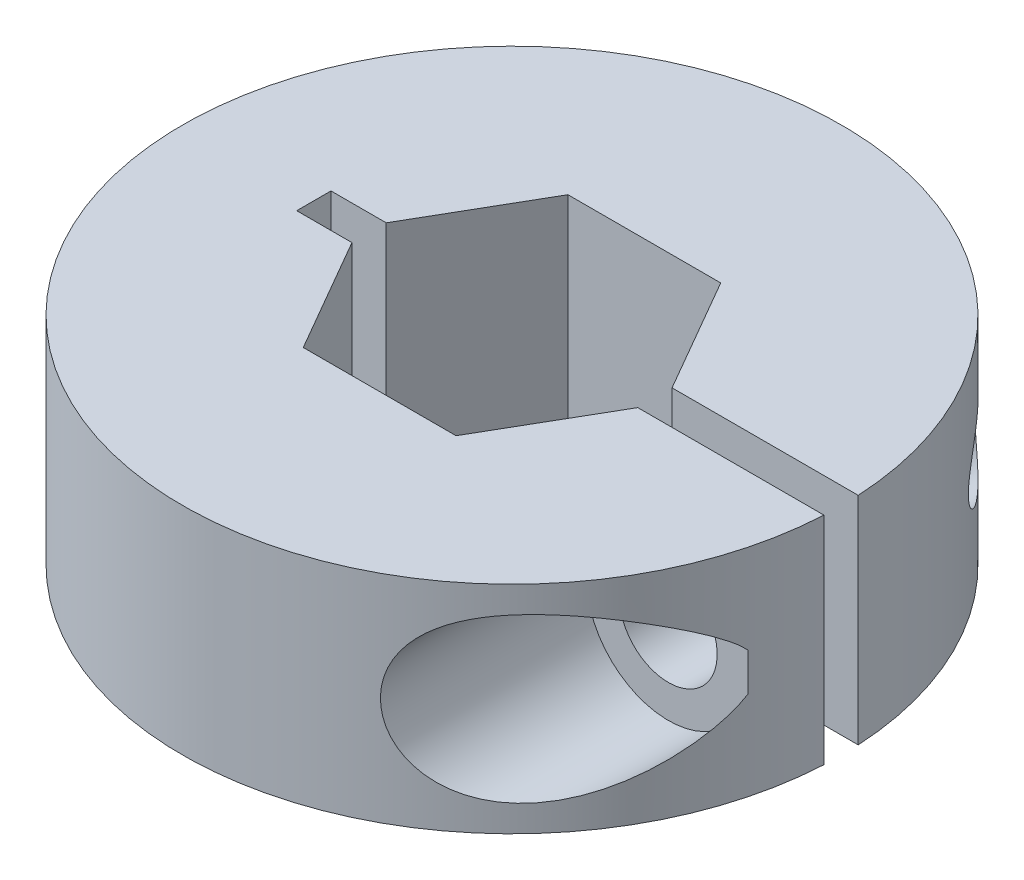
ISO-10303-21;
HEADER;
FILE_DESCRIPTION(('STEP AP214'),'2;1');
FILE_NAME('part.step','',(''),(''),'','','');
FILE_SCHEMA(('AUTOMOTIVE_DESIGN { 1 0 10303 214 1 1 1 1 }'));
ENDSEC;
DATA;
#1=APPLICATION_CONTEXT('core data for automotive mechanical design processes');
#2=APPLICATION_PROTOCOL_DEFINITION('international standard','automotive_design',2000,#1);
#3=PRODUCT_CONTEXT('',#1,'mechanical');
#4=PRODUCT('Part','Part','',(#3));
#5=PRODUCT_RELATED_PRODUCT_CATEGORY('part','',(#4));
#6=PRODUCT_DEFINITION_FORMATION('','',#4);
#7=PRODUCT_DEFINITION_CONTEXT('part definition',#1,'design');
#8=PRODUCT_DEFINITION('design','',#6,#7);
#9=PRODUCT_DEFINITION_SHAPE('','',#8);
#10=(LENGTH_UNIT() NAMED_UNIT(*) SI_UNIT(.MILLI.,.METRE.));
#11=(NAMED_UNIT(*) PLANE_ANGLE_UNIT() SI_UNIT($,.RADIAN.));
#12=(NAMED_UNIT(*) SI_UNIT($,.STERADIAN.) SOLID_ANGLE_UNIT());
#13=UNCERTAINTY_MEASURE_WITH_UNIT(LENGTH_MEASURE(1.E-05),#10,'distance_accuracy_value','');
#14=(GEOMETRIC_REPRESENTATION_CONTEXT(3) GLOBAL_UNCERTAINTY_ASSIGNED_CONTEXT((#13)) GLOBAL_UNIT_ASSIGNED_CONTEXT((#10,
#11,#12)) REPRESENTATION_CONTEXT('',''));
#15=CARTESIAN_POINT('',(0.,0.,0.));
#16=DIRECTION('',(0.,0.,1.));
#17=DIRECTION('',(1.,0.,0.));
#18=AXIS2_PLACEMENT_3D('',#15,#16,#17);
#19=CARTESIAN_POINT('',(11.5355224713626,5.207,-0.8255));
#20=DIRECTION('',(0.,0.,1.));
#21=DIRECTION('',(1.,0.,0.));
#22=AXIS2_PLACEMENT_3D('',#19,#20,#21);
#23=CYLINDRICAL_SURFACE('',#22,1.7272);
#24=CARTESIAN_POINT('',(11.5355224713626,5.207,-0.8255));
#25=DIRECTION('',(0.,0.,1.));
#26=DIRECTION('',(1.,0.,0.));
#27=AXIS2_PLACEMENT_3D('',#24,#25,#26);
#28=CIRCLE('',#27,1.7272);
#29=CARTESIAN_POINT('',(13.2627224713626,5.207,-0.8255));
#30=VERTEX_POINT('',#29);
#31=EDGE_CURVE('E149',#30,#30,#28,.T.);
#32=ORIENTED_EDGE('',*,*,#31,.T.);
#33=EDGE_LOOP('',(#32));
#34=FACE_BOUND('',#33,.T.);
#35=CARTESIAN_POINT('',(9.80832247136264,5.20699999999743,-12.4824851410992));
#36=CARTESIAN_POINT('',(9.80832717981811,5.12563487030982,-12.4824821258486));
#37=CARTESIAN_POINT('',(9.81411079583699,5.0442256232286,-12.4779435373603));
#38=CARTESIAN_POINT('',(9.83686582287657,4.88396366971117,-12.4600118301465));
#39=CARTESIAN_POINT('',(9.85384699497057,4.80511325682585,-12.4466109860338));
#40=CARTESIAN_POINT('',(9.89781460406895,4.6525532944237,-12.4116746379421));
#41=CARTESIAN_POINT('',(9.92476014673078,4.57882417582134,-12.390172375933));
#42=CARTESIAN_POINT('',(9.98715397992801,4.43775969125408,-12.3399342921144));
#43=CARTESIAN_POINT('',(10.022603109197,4.37042495690105,-12.3111977567536));
#44=CARTESIAN_POINT('',(10.1027776748239,4.23914613421888,-12.245503092222));
#45=CARTESIAN_POINT('',(10.14794322383,4.17567411284794,-12.2081444959402));
#46=CARTESIAN_POINT('',(10.2441079781266,4.05752972333503,-12.127564817614));
#47=CARTESIAN_POINT('',(10.2951102530445,4.00286202224389,-12.0843406485308));
#48=CARTESIAN_POINT('',(10.4279541873246,3.87712784857541,-11.9701449755629));
#49=CARTESIAN_POINT('',(10.5124336095879,3.81158833642804,-11.8961299284085));
#50=CARTESIAN_POINT('',(10.6864152434717,3.69935097703062,-11.7400987839687));
#51=CARTESIAN_POINT('',(10.7759285135658,3.65269661801682,-11.6580647535705));
#52=CARTESIAN_POINT('',(10.9876347057071,3.56372770631253,-11.4592780978034));
#53=CARTESIAN_POINT('',(11.1105618290983,3.52831914863097,-11.3402260797538));
#54=CARTESIAN_POINT('',(11.3547038190156,3.48481171790953,-11.0957793487054));
#55=CARTESIAN_POINT('',(11.4759172572962,3.4767344250237,-10.9703797030103));
#56=CARTESIAN_POINT('',(11.7165145741764,3.48499784045012,-10.713107641636));
#57=CARTESIAN_POINT('',(11.8357861765314,3.50192450935579,-10.5811522006071));
#58=CARTESIAN_POINT('',(12.0674609420617,3.55941700457341,-10.3161509065639));
#59=CARTESIAN_POINT('',(12.1798593905749,3.59999886064155,-10.1831043745149));
#60=CARTESIAN_POINT('',(12.3400088133385,3.67749864288504,-9.98732469929324));
#61=CARTESIAN_POINT('',(12.3911829471804,3.70549591029297,-9.92374495110965));
#62=CARTESIAN_POINT('',(12.4912287531848,3.7671047920721,-9.79751484604641));
#63=CARTESIAN_POINT('',(12.5401013174625,3.80071420775975,-9.73486413562075));
#64=CARTESIAN_POINT('',(12.6351852338489,3.87375177739436,-9.61112891382545));
#65=CARTESIAN_POINT('',(12.6814007081626,3.91317056044534,-9.55004206271455));
#66=CARTESIAN_POINT('',(12.7708305377531,3.99826452456761,-9.4301166461838));
#67=CARTESIAN_POINT('',(12.8140468770234,4.04393550905798,-9.37127660626456));
#68=CARTESIAN_POINT('',(12.9000943738688,4.14589137436045,-9.25251107317332));
#69=CARTESIAN_POINT('',(12.9426460987988,4.20271940107025,-9.19284355732076));
#70=CARTESIAN_POINT('',(13.0225103587165,4.32528009175886,-9.0793525390714));
#71=CARTESIAN_POINT('',(13.0598280522777,4.39100386086868,-9.02552329460823));
#72=CARTESIAN_POINT('',(13.1200452532256,4.51688883087252,-8.93768621875741));
#73=CARTESIAN_POINT('',(13.1443146866712,4.57514230851238,-8.90191501244982));
#74=CARTESIAN_POINT('',(13.1872208475752,4.69777026832146,-8.83822975737732));
#75=CARTESIAN_POINT('',(13.2058644759664,4.76213712293275,-8.81030608529239));
#76=CARTESIAN_POINT('',(13.234325563421,4.88910807383453,-8.76748832758546));
#77=CARTESIAN_POINT('',(13.2448675286978,4.95117965655284,-8.75152917271738));
#78=CARTESIAN_POINT('',(13.2590584707905,5.07784361741996,-8.7300155693831));
#79=CARTESIAN_POINT('',(13.2627194459847,5.14243140688724,-8.72444300995837));
#80=CARTESIAN_POINT('',(13.262725145981,5.26408257050599,-8.72443348794094));
#81=CARTESIAN_POINT('',(13.2598688997014,5.32115013783756,-8.72878038022016));
#82=CARTESIAN_POINT('',(13.2487365570514,5.43352137959228,-8.74566773124609));
#83=CARTESIAN_POINT('',(13.2404558333609,5.48882350573794,-8.75821518541536));
#84=CARTESIAN_POINT('',(13.2166269340722,5.60913390677291,-8.79414330968239));
#85=CARTESIAN_POINT('',(13.199819520121,5.67332649999486,-8.81938955673118));
#86=CARTESIAN_POINT('',(13.1604822969934,5.79597850138733,-8.87798279397336));
#87=CARTESIAN_POINT('',(13.1379415408771,5.85442664205613,-8.91134527550615));
#88=CARTESIAN_POINT('',(13.0752089482557,5.99523365279143,-9.00327894915459));
#89=CARTESIAN_POINT('',(13.0320255705073,6.073655092563,-9.06578752971956));
#90=CARTESIAN_POINT('',(12.9383837057909,6.21826021759132,-9.19894193080987));
#91=CARTESIAN_POINT('',(12.8879066178535,6.28441159472208,-9.26960846078696));
#92=CARTESIAN_POINT('',(12.7911223446032,6.39487415168808,-9.40256955155641));
#93=CARTESIAN_POINT('',(12.7457160713092,6.44097092437183,-9.46406191074572));
#94=CARTESIAN_POINT('',(12.6517829098795,6.52655428085678,-9.58927232519942));
#95=CARTESIAN_POINT('',(12.6032541298207,6.56603680388528,-9.65299171893625));
#96=CARTESIAN_POINT('',(12.5034802248503,6.63881395842752,-9.78188389284458));
#97=CARTESIAN_POINT('',(12.4522333923453,6.67210463934609,-9.84705757140325));
#98=CARTESIAN_POINT('',(12.3473470136312,6.73272208765695,-9.97826239329041));
#99=CARTESIAN_POINT('',(12.2937065215548,6.76004647184662,-10.0442938681432));
#100=CARTESIAN_POINT('',(12.1242864398467,6.8356123851239,-10.2493719701347));
#101=CARTESIAN_POINT('',(12.0048171331494,6.8739700354809,-10.3891498294603));
#102=CARTESIAN_POINT('',(11.7586774724809,6.92431613088359,-10.6669377492714));
#103=CARTESIAN_POINT('',(11.6320119395124,6.9363220210857,-10.8049489191168));
#104=CARTESIAN_POINT('',(11.3885918016584,6.93174040892143,-11.0608861221596));
#105=CARTESIAN_POINT('',(11.2723284996894,6.91822212597253,-11.1793231562402));
#106=CARTESIAN_POINT('',(11.0390540167357,6.86561354304054,-11.4097164549072));
#107=CARTESIAN_POINT('',(10.9220439388385,6.82655489777794,-11.5216805553272));
#108=CARTESIAN_POINT('',(10.7216922033512,6.73335386320795,-11.7078861429454));
#109=CARTESIAN_POINT('',(10.6374548545198,6.68570575256117,-11.7844057075281));
#110=CARTESIAN_POINT('',(10.4740584622924,6.57313435558642,-11.9298622687799));
#111=CARTESIAN_POINT('',(10.3948927866374,6.50823422676082,-11.9988092561364));
#112=CARTESIAN_POINT('',(10.261057782096,6.37571888645794,-12.1133162545035));
#113=CARTESIAN_POINT('',(10.204708395014,6.31144129073364,-12.1607639842875));
#114=CARTESIAN_POINT('',(10.1002119172092,6.17172132487359,-12.2476917458352));
#115=CARTESIAN_POINT('',(10.0520576429292,6.09628884228355,-12.2871787613552));
#116=CARTESIAN_POINT('',(9.97311933777412,5.9473580255924,-12.3513043133526));
#117=CARTESIAN_POINT('',(9.94081685438444,5.87524183963921,-12.3772779687403));
#118=CARTESIAN_POINT('',(9.88593705295111,5.72512028865784,-12.4211560456636));
#119=CARTESIAN_POINT('',(9.86334660751703,5.64712304161943,-12.439071360875));
#120=CARTESIAN_POINT('',(9.83379783381764,5.50859138898149,-12.4624353660991));
#121=CARTESIAN_POINT('',(9.82427937970143,5.44893325171343,-12.4699328809969));
#122=CARTESIAN_POINT('',(9.81153959665097,5.32852502649915,-12.4799591655278));
#123=CARTESIAN_POINT('',(9.80831895443179,5.26777482020222,-12.4824873933087));
#124=CARTESIAN_POINT('',(9.80832247136264,5.20699999999743,-12.4824851410992));
#125=B_SPLINE_CURVE_WITH_KNOTS('',3,(#35,#36,#37,#38,#39,#40,#41,#42,#43,#44,#45,#46,#47,#48,
#49,#50,#51,#52,#53,#54,#55,#56,#57,#58,#59,#60,#61,#62,#63,#64,#65,#66,#67,#68,#69,#70,#71,#72,
#73,#74,#75,#76,#77,#78,#79,#80,#81,#82,#83,#84,#85,#86,#87,#88,#89,#90,#91,#92,#93,#94,#95,#96,
#97,#98,#99,#100,#101,#102,#103,#104,#105,#106,#107,#108,#109,#110,#111,#112,#113,#114,#115,
#116,#117,#118,#119,#120,#121,#122,#123,#124),.UNSPECIFIED.,.T.,.F.,(4,2,2,2,2,2,2,2,2,2,2,2,2,
2,2,2,2,2,2,2,2,2,2,2,2,2,2,2,2,2,2,2,2,2,2,2,2,2,2,2,2,2,2,2,4),(0.,0.243850099537198,
0.487913048275523,0.730985268523845,0.974081473560499,1.23231192329565,1.49067881012542,
1.87862942568134,2.26746838993736,2.78891332927559,3.31076989389637,3.84505162845797,
4.37969583653259,4.63837853438194,4.89696012430514,5.15512908000341,5.41312559040198,
5.69074990671668,5.96809864894905,6.18502253006738,6.40167922807831,6.59544081814176,
6.78886423166116,6.95986231459054,7.13100645676755,7.34281289452125,7.55502682048568,
7.88077712761974,8.20737335088665,8.47480972295327,8.74240968872904,9.01017981057518,
9.27805669676576,9.8394344127398,10.4004403782291,10.8982375632774,11.3954189450155,
11.7642884082849,12.1326652141258,12.4248541919804,12.7167857127508,12.9652811581962,
13.21343965769,13.3955610444386,13.5777022886447),.UNSPECIFIED.);
#126=CARTESIAN_POINT('',(9.80832247136264,5.20699999999743,-12.4824851410992));
#127=VERTEX_POINT('',#126);
#128=EDGE_CURVE('E124',#127,#127,#125,.T.);
#129=ORIENTED_EDGE('',*,*,#128,.F.);
#130=EDGE_LOOP('',(#129));
#131=FACE_BOUND('',#130,.T.);
#132=ADVANCED_FACE('F17',(#34,#131),#23,.F.);
#133=CARTESIAN_POINT('',(11.5355224713626,5.207,4.0005));
#134=DIRECTION('',(0.,0.,-1.));
#135=DIRECTION('',(-1.,0.,0.));
#136=AXIS2_PLACEMENT_3D('',#133,#134,#135);
#137=PLANE('',#136);
#138=DIRECTION('',(0.,-1.,0.));
#139=VECTOR('',#138,1.);
#140=CARTESIAN_POINT('',(15.3626698444639,10.414,4.0005));
#141=LINE('',#140,#139);
#142=CARTESIAN_POINT('',(15.3626698444639,6.13053234083285,4.0005));
#143=VERTEX_POINT('',#142);
#144=CARTESIAN_POINT('',(15.3626698444639,4.28346765916715,4.0005));
#145=VERTEX_POINT('',#144);
#146=EDGE_CURVE('E109',#143,#145,#141,.T.);
#147=ORIENTED_EDGE('',*,*,#146,.F.);
#148=CARTESIAN_POINT('',(11.5355224713626,5.207,4.0005));
#149=DIRECTION('',(0.,0.,-1.));
#150=DIRECTION('',(-1.,0.,0.));
#151=AXIS2_PLACEMENT_3D('',#148,#149,#150);
#152=CIRCLE('',#151,3.937);
#153=EDGE_CURVE('E21',#143,#145,#152,.F.);
#154=ORIENTED_EDGE('',*,*,#153,.T.);
#155=EDGE_LOOP('',(#147,#154));
#156=FACE_BOUND('',#155,.T.);
#157=CARTESIAN_POINT('',(11.5355224713626,5.207,4.0005));
#158=DIRECTION('',(0.,0.,-1.));
#159=DIRECTION('',(-1.,0.,0.));
#160=AXIS2_PLACEMENT_3D('',#157,#158,#159);
#161=CIRCLE('',#160,2.3495);
#162=CARTESIAN_POINT('',(9.18602247136264,5.207,4.0005));
#163=VERTEX_POINT('',#162);
#164=EDGE_CURVE('E116',#163,#163,#161,.T.);
#165=ORIENTED_EDGE('',*,*,#164,.T.);
#166=EDGE_LOOP('',(#165));
#167=FACE_BOUND('',#166,.T.);
#168=ADVANCED_FACE('F112',(#156,#167),#137,.F.);
#169=CARTESIAN_POINT('',(11.5355224713626,5.207,15.875));
#170=DIRECTION('',(0.,0.,-1.));
#171=DIRECTION('',(-1.,0.,0.));
#172=AXIS2_PLACEMENT_3D('',#169,#170,#171);
#173=CYLINDRICAL_SURFACE('',#172,3.937);
#174=CARTESIAN_POINT('',(15.3626698444639,4.28346765916715,4.0005));
#175=CARTESIAN_POINT('',(15.3479878102032,4.22275565161266,4.05691337523431));
#176=CARTESIAN_POINT('',(15.3324022229872,4.16437618974075,4.11546175466009));
#177=CARTESIAN_POINT('',(15.2996213319844,4.05156142205026,4.23568386274317));
#178=CARTESIAN_POINT('',(15.2824281858667,3.99712099861108,4.29735335262564));
#179=CARTESIAN_POINT('',(15.2466523266804,3.89149158169119,4.42260897160088));
#180=CARTESIAN_POINT('',(15.2280746739571,3.84029190125644,4.48618765839513));
#181=CARTESIAN_POINT('',(15.1895554439536,3.74041279747954,4.61492644979825));
#182=CARTESIAN_POINT('',(15.1696133417435,3.69173435690481,4.68008715674993));
#183=CARTESIAN_POINT('',(15.1078570278175,3.54893582596276,4.87721334));
#184=CARTESIAN_POINT('',(15.0640962288833,3.4580047315441,5.01088134940333));
#185=CARTESIAN_POINT('',(14.9715754713928,3.2825976491534,5.28090788528207));
#186=CARTESIAN_POINT('',(14.9228091231074,3.19813015825649,5.41726966663242));
#187=CARTESIAN_POINT('',(14.8190639822993,3.03257761196911,5.69504326840225));
#188=CARTESIAN_POINT('',(14.7639560574971,2.95163881999537,5.83649388621773));
#189=CARTESIAN_POINT('',(14.6486274420097,2.79494597008219,6.1201959521816));
#190=CARTESIAN_POINT('',(14.588406127807,2.71919254647732,6.26244749601315));
#191=CARTESIAN_POINT('',(14.4628364883902,2.57258998585137,6.54722863005592));
#192=CARTESIAN_POINT('',(14.3974878864736,2.50174111390135,6.68975823486785));
#193=CARTESIAN_POINT('',(14.2616342247146,2.36489288413567,6.97469271710385));
#194=CARTESIAN_POINT('',(14.1911287034649,2.2988939613233,7.11709758221064));
#195=CARTESIAN_POINT('',(13.971394039715,2.10792124042986,7.5444373570761));
#196=CARTESIAN_POINT('',(13.8142859919674,1.99036865854931,7.8287231889667));
#197=CARTESIAN_POINT('',(13.4789401877745,1.77734955008738,8.39293840159205));
#198=CARTESIAN_POINT('',(13.3007148666307,1.68187012212227,8.67287023746034));
#199=CARTESIAN_POINT('',(12.9915561505229,1.54678540402948,9.12582793724426));
#200=CARTESIAN_POINT('',(12.8668771170751,1.49946871418071,9.30084848782579));
#201=CARTESIAN_POINT('',(12.6090840863585,1.41678137130894,9.64744697054715));
#202=CARTESIAN_POINT('',(12.4759723168987,1.38140757864394,9.81902579630081));
#203=CARTESIAN_POINT('',(12.2020090945498,1.32430912731004,10.1574537187412));
#204=CARTESIAN_POINT('',(12.0611804684445,1.30254635077404,10.3243147632318));
#205=CARTESIAN_POINT('',(11.772059294533,1.27443029437688,10.6527961538095));
#206=CARTESIAN_POINT('',(11.6237688598588,1.26807267667396,10.8144179625303));
#207=CARTESIAN_POINT('',(11.3590386442215,1.27232843168268,11.0912002745417));
#208=CARTESIAN_POINT('',(11.2440178879362,1.27905977105735,11.2077822414065));
#209=CARTESIAN_POINT('',(11.0110206272912,1.30333697601727,11.4367703196799));
#210=CARTESIAN_POINT('',(10.8930448900605,1.32088006216659,11.5491774964532));
#211=CARTESIAN_POINT('',(10.6549938433969,1.36781553609753,11.7691527775727));
#212=CARTESIAN_POINT('',(10.5349194149357,1.39720306101238,11.8767228477249));
#213=CARTESIAN_POINT('',(10.2938264808753,1.46881899955507,12.0862870712476));
#214=CARTESIAN_POINT('',(10.1728082033244,1.51104439961536,12.1882825265834));
#215=CARTESIAN_POINT('',(9.86269602701548,1.63723289025655,12.4419548513044));
#216=CARTESIAN_POINT('',(9.67377707875075,1.73129788358493,12.5891368573382));
#217=CARTESIAN_POINT('',(9.39677285110241,1.89981893379243,12.7956919113699));
#218=CARTESIAN_POINT('',(9.30547084093701,1.96058826630367,12.8621939087458));
#219=CARTESIAN_POINT('',(9.12605364971955,2.09143672626057,12.9901058923641));
#220=CARTESIAN_POINT('',(9.03793685623561,2.16151105689104,13.0515184759322));
#221=CARTESIAN_POINT('',(8.86526107929711,2.31167801455134,13.1694274438993));
#222=CARTESIAN_POINT('',(8.78074296133298,2.39185801348645,13.2258726135014));
#223=CARTESIAN_POINT('',(8.6174881085176,2.56145899146746,13.3328181608556));
#224=CARTESIAN_POINT('',(8.5387484126198,2.65087518023578,13.3833215914599));
#225=CARTESIAN_POINT('',(8.38832843075282,2.83854037087476,13.4781111614606));
#226=CARTESIAN_POINT('',(8.31664878273625,2.9367901694272,13.5223967391596));
#227=CARTESIAN_POINT('',(8.1816706493196,3.14141055420884,13.6044894795277));
#228=CARTESIAN_POINT('',(8.11837035670216,3.24777938153861,13.6422980396467));
#229=CARTESIAN_POINT('',(8.00987226366944,3.45169536386822,13.7062373247114));
#230=CARTESIAN_POINT('',(7.96338061540921,3.54827550254554,13.7332667186427));
#231=CARTESIAN_POINT('',(7.87807206004239,3.74596943489494,13.7823811410253));
#232=CARTESIAN_POINT('',(7.83925398980004,3.84708253862027,13.8044669188809));
#233=CARTESIAN_POINT('',(7.76993564409347,4.05283882477071,13.8436017111436));
#234=CARTESIAN_POINT('',(7.73941921008302,4.15747469750121,13.8606605156672));
#235=CARTESIAN_POINT('',(7.68707603512783,4.36953406610977,13.8897583001351));
#236=CARTESIAN_POINT('',(7.66524536432487,4.47695627782564,13.9017995503798));
#237=CARTESIAN_POINT('',(7.63152673337708,4.68780683625198,13.9203366844235));
#238=CARTESIAN_POINT('',(7.61916427158377,4.79113634770182,13.9270976072505));
#239=CARTESIAN_POINT('',(7.6026624262147,4.99864498574389,13.9361127618243));
#240=CARTESIAN_POINT('',(7.59852270629123,5.10282407740937,13.9383671779078));
#241=CARTESIAN_POINT('',(7.5985222477051,5.30617792118184,13.9383672945682));
#242=CARTESIAN_POINT('',(7.60227384067791,5.40535297007697,13.9363241186614));
#243=CARTESIAN_POINT('',(7.61723525963308,5.60300459575066,13.928152240088));
#244=CARTESIAN_POINT('',(7.62844764432629,5.70148092118485,13.9220221357904));
#245=CARTESIAN_POINT('',(7.65821066819937,5.89708684955576,13.9056723004103));
#246=CARTESIAN_POINT('',(7.67676951771938,5.99421481944293,13.8954479935369));
#247=CARTESIAN_POINT('',(7.72100155567333,6.18634798128349,13.8709191792269));
#248=CARTESIAN_POINT('',(7.74667746025995,6.28135234779622,13.8566131139671));
#249=CARTESIAN_POINT('',(7.80475861779909,6.46831856263354,13.8239818204519));
#250=CARTESIAN_POINT('',(7.83714752421597,6.56028718396683,13.8056663493477));
#251=CARTESIAN_POINT('',(7.9082948299623,6.74082603305535,13.7650344954205));
#252=CARTESIAN_POINT('',(7.94705558267422,6.82939499021128,13.7427166340738));
#253=CARTESIAN_POINT('',(8.0721808117285,7.0890277502083,13.669851615984));
#254=CARTESIAN_POINT('',(8.16746579773784,7.25426296090916,13.613350511379));
#255=CARTESIAN_POINT('',(8.38023664148368,7.56948857836848,13.4834399219929));
#256=CARTESIAN_POINT('',(8.49825854040407,7.71893826474841,13.409610157349));
#257=CARTESIAN_POINT('',(8.74957567410377,7.99507049304763,13.2469971844311));
#258=CARTESIAN_POINT('',(8.88287470526024,8.12174735573009,13.1582102567057));
#259=CARTESIAN_POINT('',(9.17333286774904,8.36280467816294,12.9576112848665));
#260=CARTESIAN_POINT('',(9.33154773116066,8.47472691297465,12.8443900538442));
#261=CARTESIAN_POINT('',(9.65428939322964,8.67061419816635,12.6036057160222));
#262=CARTESIAN_POINT('',(9.81882097050879,8.75455759842644,12.476031604536));
#263=CARTESIAN_POINT('',(10.1063942318282,8.87787554042606,12.2434192249707));
#264=CARTESIAN_POINT('',(10.2291619701155,8.92316197074559,12.1410849265377));
#265=CARTESIAN_POINT('',(10.4739459333705,9.00034867771037,11.9305544676518));
#266=CARTESIAN_POINT('',(10.5959618599667,9.03224393948072,11.8223561282632));
#267=CARTESIAN_POINT('',(10.8380765260445,9.08370942049785,11.6008054541884));
#268=CARTESIAN_POINT('',(10.9581732472263,9.10326740269288,11.4874481214975));
#269=CARTESIAN_POINT('',(11.1954358561384,9.13110263226016,11.2563445197416));
#270=CARTESIAN_POINT('',(11.3126008861603,9.13937661535588,11.1385969907806));
#271=CARTESIAN_POINT('',(11.5906651957885,9.14697850608397,10.8502075969938));
#272=CARTESIAN_POINT('',(11.7497731659824,9.14123958565272,10.6776948656422));
#273=CARTESIAN_POINT('',(12.0594833007259,9.11207924724684,10.3266334158647));
#274=CARTESIAN_POINT('',(12.210082013693,9.08865070845251,10.1480822943862));
#275=CARTESIAN_POINT('',(12.5024667359594,9.02634542611127,9.78561868660148));
#276=CARTESIAN_POINT('',(12.6442236222153,8.98742045902445,9.6016911406931));
#277=CARTESIAN_POINT('',(12.9180156125724,8.89610609889064,9.23004869670352));
#278=CARTESIAN_POINT('',(13.0500507420854,8.84371674104015,9.04233380852378));
#279=CARTESIAN_POINT('',(13.3571205459225,8.70285192447388,8.5852793467519));
#280=CARTESIAN_POINT('',(13.5272188246243,8.60842811081369,8.31444092228136));
#281=CARTESIAN_POINT('',(13.8477121070539,8.39923865397046,7.76895600025403));
#282=CARTESIAN_POINT('',(13.9980984448568,8.28446411585582,7.49430788613392));
#283=CARTESIAN_POINT('',(14.2789287198181,8.03695707635389,6.94425979076778));
#284=CARTESIAN_POINT('',(14.4094391326663,7.90428736502318,6.66886559770527));
#285=CARTESIAN_POINT('',(14.5908632188828,7.69165505865686,6.25659046877553));
#286=CARTESIAN_POINT('',(14.6489523605682,7.61849894828284,6.11928881121582));
#287=CARTESIAN_POINT('',(14.7603688768232,7.46734540028237,5.8454228177202));
#288=CARTESIAN_POINT('',(14.8136967722155,7.38934849376647,5.70885840267812));
#289=CARTESIAN_POINT('',(14.9166218756621,7.22631233038639,5.43433064414275));
#290=CARTESIAN_POINT('',(14.9661196287084,7.14116111755783,5.29639641567637));
#291=CARTESIAN_POINT('',(15.0599986970644,6.96429254956974,5.0232314084554));
#292=CARTESIAN_POINT('',(15.1043865041919,6.87258377104784,4.88799738403351));
#293=CARTESIAN_POINT('',(15.1670188940949,6.72849131217973,4.68850127247438));
#294=CARTESIAN_POINT('',(15.1872487759024,6.67934171962997,4.62252424359808));
#295=CARTESIAN_POINT('',(15.2263140536073,6.57847738199272,4.49217246094487));
#296=CARTESIAN_POINT('',(15.245149995421,6.52676365450473,4.42779708653059));
#297=CARTESIAN_POINT('',(15.2814126705047,6.42004736638053,4.30097554620276));
#298=CARTESIAN_POINT('',(15.2988342137864,6.36503387703464,4.23853696285176));
#299=CARTESIAN_POINT('',(15.3320366362743,6.25098975542748,4.11683563054204));
#300=CARTESIAN_POINT('',(15.3478152679021,6.1919537981508,4.05757728459943));
#301=CARTESIAN_POINT('',(15.3626698444639,6.13053234083285,4.0005));
#302=B_SPLINE_CURVE_WITH_KNOTS('',3,(#174,#175,#176,#177,#178,#179,#180,#181,#182,#183,#184,
#185,#186,#187,#188,#189,#190,#191,#192,#193,#194,#195,#196,#197,#198,#199,#200,#201,#202,#203,
#204,#205,#206,#207,#208,#209,#210,#211,#212,#213,#214,#215,#216,#217,#218,#219,#220,#221,#222,
#223,#224,#225,#226,#227,#228,#229,#230,#231,#232,#233,#234,#235,#236,#237,#238,#239,#240,#241,
#242,#243,#244,#245,#246,#247,#248,#249,#250,#251,#252,#253,#254,#255,#256,#257,#258,#259,#260,
#261,#262,#263,#264,#265,#266,#267,#268,#269,#270,#271,#272,#273,#274,#275,#276,#277,#278,#279,
#280,#281,#282,#283,#284,#285,#286,#287,#288,#289,#290,#291,#292,#293,#294,#295,#296,#297,#298,
#299,#300,#301),.UNSPECIFIED.,.F.,.F.,(4,2,2,2,2,2,2,2,2,2,2,2,2,2,2,2,2,2,2,2,2,2,2,2,2,2,2,2,
2,2,2,2,2,2,2,2,2,2,2,2,2,2,2,2,2,2,2,2,2,2,2,2,2,2,2,2,2,2,2,2,2,2,2,4),(0.,0.252300166186265,
0.504266427044793,0.755353101599771,1.00653692313728,1.50867311833266,2.01145847050861,
2.52739500852454,3.04339454951537,3.55942195644272,4.07549559072576,5.11043609650659,
6.14477015910132,6.80443904454097,7.46393437579826,8.12157441111865,8.77902924418817,
9.27037179618476,9.76158808867368,10.2526029119244,10.7435025630497,11.5118006611944,
11.8962083657607,12.2804186682879,12.6682137011599,13.0558086075284,13.4434385052704,
13.8309846642541,14.1621653653042,14.4932958285143,14.8237770816936,15.1541086387117,
15.4665476745354,15.778973929912,16.0764110512768,16.3739502326029,16.6718228840216,
16.9698093724402,17.267078597078,17.5644578630547,18.1584430634253,18.7686780476532,
19.3790650058211,20.0498691860583,20.7211912383227,21.218903957713,21.716802900246,
22.2151949234622,22.7137310927856,23.4169231103718,24.1203983435037,24.8260800601308,
25.5317599320949,26.5307357433862,27.5301492700338,28.5261431295542,29.0242320593993,
29.5222664374242,30.0305580234349,30.5381965640633,30.7923122657133,31.0463279141298,
31.3012370697987,31.5564904934787),.UNSPECIFIED.);
#303=EDGE_CURVE('E117',#145,#143,#302,.T.);
#304=ORIENTED_EDGE('',*,*,#303,.F.);
#305=ORIENTED_EDGE('',*,*,#153,.F.);
#306=EDGE_LOOP('',(#304,#305));
#307=FACE_BOUND('',#306,.T.);
#308=ADVANCED_FACE('F118',(#307),#173,.F.);
#309=CARTESIAN_POINT('',(11.5355224713626,5.207,51.6255));
#310=DIRECTION('',(0.,0.,-1.));
#311=DIRECTION('',(-1.,0.,0.));
#312=AXIS2_PLACEMENT_3D('',#309,#310,#311);
#313=CYLINDRICAL_SURFACE('',#312,2.3495);
#314=ORIENTED_EDGE('',*,*,#164,.F.);
#315=EDGE_LOOP('',(#314));
#316=FACE_BOUND('',#315,.T.);
#317=CARTESIAN_POINT('',(11.5355224713626,5.207,0.8255));
#318=DIRECTION('',(0.,0.,-1.));
#319=DIRECTION('',(-1.,0.,0.));
#320=AXIS2_PLACEMENT_3D('',#317,#318,#319);
#321=CIRCLE('',#320,2.3495);
#322=CARTESIAN_POINT('',(9.18602247136264,5.207,0.8255));
#323=VERTEX_POINT('',#322);
#324=EDGE_CURVE('E212',#323,#323,#321,.T.);
#325=ORIENTED_EDGE('',*,*,#324,.T.);
#326=EDGE_LOOP('',(#325));
#327=FACE_BOUND('',#326,.T.);
#328=ADVANCED_FACE('F255',(#316,#327),#313,.F.);
#329=CARTESIAN_POINT('',(-9.54647752863736,10.414,-0.8255));
#330=DIRECTION('',(-1.,0.,0.));
#331=DIRECTION('',(0.,0.,1.));
#332=AXIS2_PLACEMENT_3D('',#329,#330,#331);
#333=PLANE('',#332);
#334=DIRECTION('',(0.,1.,0.));
#335=VECTOR('',#334,1.);
#336=CARTESIAN_POINT('',(-9.54647752863736,10.414,-0.8255));
#337=LINE('',#336,#335);
#338=CARTESIAN_POINT('',(-9.54647752863736,0.,-0.8255));
#339=VERTEX_POINT('',#338);
#340=CARTESIAN_POINT('',(-9.54647752863736,10.414,-0.8255));
#341=VERTEX_POINT('',#340);
#342=EDGE_CURVE('E171',#339,#341,#337,.T.);
#343=ORIENTED_EDGE('',*,*,#342,.T.);
#344=DIRECTION('',(0.,0.,1.));
#345=VECTOR('',#344,1.);
#346=CARTESIAN_POINT('',(-9.54647752863736,10.414,-0.8255));
#347=LINE('',#346,#345);
#348=CARTESIAN_POINT('',(-9.54647752863736,10.414,0.825499999999998));
#349=VERTEX_POINT('',#348);
#350=EDGE_CURVE('E35',#349,#341,#347,.F.);
#351=ORIENTED_EDGE('',*,*,#350,.F.);
#352=DIRECTION('',(0.,1.,0.));
#353=VECTOR('',#352,1.);
#354=CARTESIAN_POINT('',(-9.54647752863736,10.414,0.825499999999998));
#355=LINE('',#354,#353);
#356=CARTESIAN_POINT('',(-9.54647752863736,0.,0.825499999999998));
#357=VERTEX_POINT('',#356);
#358=EDGE_CURVE('E327',#349,#357,#355,.F.);
#359=ORIENTED_EDGE('',*,*,#358,.T.);
#360=DIRECTION('',(0.,0.,1.));
#361=VECTOR('',#360,1.);
#362=CARTESIAN_POINT('',(-9.54647752863736,0.,0.));
#363=LINE('',#362,#361);
#364=EDGE_CURVE('E176',#357,#339,#363,.F.);
#365=ORIENTED_EDGE('',*,*,#364,.T.);
#366=EDGE_LOOP('',(#343,#351,#359,#365));
#367=FACE_BOUND('',#366,.T.);
#368=ADVANCED_FACE('F252',(#367),#333,.F.);
#369=CARTESIAN_POINT('',(0.,0.,0.));
#370=DIRECTION('',(0.,1.,0.));
#371=DIRECTION('',(0.,0.,1.));
#372=AXIS2_PLACEMENT_3D('',#369,#370,#371);
#373=PLANE('',#372);
#374=DIRECTION('',(-0.5,0.,0.866025403784439));
#375=VECTOR('',#374,1.);
#376=CARTESIAN_POINT('',(-7.36167781238308,0.,0.));
#377=LINE('',#376,#375);
#378=CARTESIAN_POINT('',(-3.68083890619154,0.,-6.3754));
#379=VERTEX_POINT('',#378);
#380=CARTESIAN_POINT('',(-6.88507516516704,0.,-0.8255));
#381=VERTEX_POINT('',#380);
#382=EDGE_CURVE('E178',#379,#381,#377,.T.);
#383=ORIENTED_EDGE('',*,*,#382,.T.);
#384=DIRECTION('',(-1.,0.,0.));
#385=VECTOR('',#384,1.);
#386=CARTESIAN_POINT('',(-6.29611386094629,0.,-0.8255));
#387=LINE('',#386,#385);
#388=EDGE_CURVE('E165',#381,#339,#387,.T.);
#389=ORIENTED_EDGE('',*,*,#388,.T.);
#390=ORIENTED_EDGE('',*,*,#364,.F.);
#391=DIRECTION('',(1.,0.,0.));
#392=VECTOR('',#391,1.);
#393=CARTESIAN_POINT('',(-6.29611386094629,0.,0.825499999999998));
#394=LINE('',#393,#392);
#395=CARTESIAN_POINT('',(-6.88507516516704,0.,0.825499999999998));
#396=VERTEX_POINT('',#395);
#397=EDGE_CURVE('E329',#357,#396,#394,.T.);
#398=ORIENTED_EDGE('',*,*,#397,.T.);
#399=DIRECTION('',(0.5,0.,0.866025403784439));
#400=VECTOR('',#399,1.);
#401=CARTESIAN_POINT('',(-3.68083890619154,0.,6.3754));
#402=LINE('',#401,#400);
#403=CARTESIAN_POINT('',(-3.68083890619154,0.,6.3754));
#404=VERTEX_POINT('',#403);
#405=EDGE_CURVE('E303',#396,#404,#402,.T.);
#406=ORIENTED_EDGE('',*,*,#405,.T.);
#407=DIRECTION('',(1.,0.,0.));
#408=VECTOR('',#407,1.);
#409=CARTESIAN_POINT('',(3.68083890619154,0.,6.3754));
#410=LINE('',#409,#408);
#411=CARTESIAN_POINT('',(3.68083890619154,0.,6.3754));
#412=VERTEX_POINT('',#411);
#413=EDGE_CURVE('E197',#404,#412,#410,.T.);
#414=ORIENTED_EDGE('',*,*,#413,.T.);
#415=DIRECTION('',(0.5,0.,-0.866025403784439));
#416=VECTOR('',#415,1.);
#417=CARTESIAN_POINT('',(7.36167781238308,0.,0.));
#418=LINE('',#417,#416);
#419=CARTESIAN_POINT('',(6.88507516516704,0.,0.825499999999998));
#420=VERTEX_POINT('',#419);
#421=EDGE_CURVE('E194',#412,#420,#418,.T.);
#422=ORIENTED_EDGE('',*,*,#421,.T.);
#423=DIRECTION('',(1.,0.,0.));
#424=VECTOR('',#423,1.);
#425=CARTESIAN_POINT('',(6.29611386094629,0.,0.825499999999998));
#426=LINE('',#425,#424);
#427=CARTESIAN_POINT('',(15.8535224713626,0.,0.825499999999998));
#428=VERTEX_POINT('',#427);
#429=EDGE_CURVE('E187',#420,#428,#426,.T.);
#430=ORIENTED_EDGE('',*,*,#429,.T.);
#431=CARTESIAN_POINT('',(0.,0.,0.));
#432=DIRECTION('',(0.,-1.,0.));
#433=DIRECTION('',(0.,0.,-1.));
#434=AXIS2_PLACEMENT_3D('',#431,#432,#433);
#435=CIRCLE('',#434,15.875);
#436=CARTESIAN_POINT('',(15.8535224713626,0.,-0.825500000000001));
#437=VERTEX_POINT('',#436);
#438=EDGE_CURVE('E120',#437,#428,#435,.F.);
#439=ORIENTED_EDGE('',*,*,#438,.F.);
#440=DIRECTION('',(-1.,0.,0.));
#441=VECTOR('',#440,1.);
#442=CARTESIAN_POINT('',(6.29611386094629,0.,-0.8255));
#443=LINE('',#442,#441);
#444=CARTESIAN_POINT('',(6.88507516516704,0.,-0.825500000000001));
#445=VERTEX_POINT('',#444);
#446=EDGE_CURVE('E137',#437,#445,#443,.T.);
#447=ORIENTED_EDGE('',*,*,#446,.T.);
#448=DIRECTION('',(-0.5,0.,-0.866025403784439));
#449=VECTOR('',#448,1.);
#450=CARTESIAN_POINT('',(3.68083890619154,0.,-6.3754));
#451=LINE('',#450,#449);
#452=CARTESIAN_POINT('',(3.68083890619154,0.,-6.3754));
#453=VERTEX_POINT('',#452);
#454=EDGE_CURVE('E150',#445,#453,#451,.T.);
#455=ORIENTED_EDGE('',*,*,#454,.T.);
#456=DIRECTION('',(-1.,0.,0.));
#457=VECTOR('',#456,1.);
#458=CARTESIAN_POINT('',(-3.68083890619154,0.,-6.3754));
#459=LINE('',#458,#457);
#460=EDGE_CURVE('E160',#453,#379,#459,.T.);
#461=ORIENTED_EDGE('',*,*,#460,.T.);
#462=EDGE_LOOP('',(#383,#389,#390,#398,#406,#414,#422,#430,#439,#447,#455,#461));
#463=FACE_BOUND('',#462,.T.);
#464=ADVANCED_FACE('F248',(#463),#373,.F.);
#465=CARTESIAN_POINT('',(-7.36167781238308,0.,0.));
#466=DIRECTION('',(-0.866025403784439,0.,-0.5));
#467=DIRECTION('',(-0.5,0.,0.866025403784439));
#468=AXIS2_PLACEMENT_3D('',#465,#466,#467);
#469=PLANE('',#468);
#470=DIRECTION('',(0.,1.,0.));
#471=VECTOR('',#470,1.);
#472=CARTESIAN_POINT('',(-3.68083890619154,0.,-6.3754));
#473=LINE('',#472,#471);
#474=CARTESIAN_POINT('',(-3.68083890619154,10.414,-6.3754));
#475=VERTEX_POINT('',#474);
#476=EDGE_CURVE('E158',#379,#475,#473,.T.);
#477=ORIENTED_EDGE('',*,*,#476,.T.);
#478=DIRECTION('',(0.5,0.,-0.866025403784439));
#479=VECTOR('',#478,1.);
#480=CARTESIAN_POINT('',(-6.88507516516704,10.414,-0.8255));
#481=LINE('',#480,#479);
#482=CARTESIAN_POINT('',(-6.88507516516704,10.414,-0.8255));
#483=VERTEX_POINT('',#482);
#484=EDGE_CURVE('E155',#483,#475,#481,.T.);
#485=ORIENTED_EDGE('',*,*,#484,.F.);
#486=DIRECTION('',(0.,1.,0.));
#487=VECTOR('',#486,1.);
#488=CARTESIAN_POINT('',(-6.88507516516704,10.414,-0.8255));
#489=LINE('',#488,#487);
#490=EDGE_CURVE('E168',#483,#381,#489,.F.);
#491=ORIENTED_EDGE('',*,*,#490,.T.);
#492=ORIENTED_EDGE('',*,*,#382,.F.);
#493=EDGE_LOOP('',(#477,#485,#491,#492));
#494=FACE_BOUND('',#493,.T.);
#495=ADVANCED_FACE('F244',(#494),#469,.F.);
#496=CARTESIAN_POINT('',(-3.68083890619154,0.,-6.3754));
#497=DIRECTION('',(0.,0.,-1.));
#498=DIRECTION('',(-1.,0.,0.));
#499=AXIS2_PLACEMENT_3D('',#496,#497,#498);
#500=PLANE('',#499);
#501=ORIENTED_EDGE('',*,*,#476,.F.);
#502=ORIENTED_EDGE('',*,*,#460,.F.);
#503=DIRECTION('',(0.,1.,0.));
#504=VECTOR('',#503,1.);
#505=CARTESIAN_POINT('',(3.68083890619154,0.,-6.3754));
#506=LINE('',#505,#504);
#507=CARTESIAN_POINT('',(3.68083890619154,10.414,-6.3754));
#508=VERTEX_POINT('',#507);
#509=EDGE_CURVE('E147',#453,#508,#506,.T.);
#510=ORIENTED_EDGE('',*,*,#509,.T.);
#511=DIRECTION('',(1.,0.,0.));
#512=VECTOR('',#511,1.);
#513=CARTESIAN_POINT('',(0.,10.414,-6.3754));
#514=LINE('',#513,#512);
#515=EDGE_CURVE('E144',#475,#508,#514,.T.);
#516=ORIENTED_EDGE('',*,*,#515,.F.);
#517=EDGE_LOOP('',(#501,#502,#510,#516));
#518=FACE_BOUND('',#517,.T.);
#519=ADVANCED_FACE('F240',(#518),#500,.F.);
#520=CARTESIAN_POINT('',(3.68083890619154,0.,-6.3754));
#521=DIRECTION('',(0.866025403784439,0.,-0.5));
#522=DIRECTION('',(-0.5,0.,-0.866025403784439));
#523=AXIS2_PLACEMENT_3D('',#520,#521,#522);
#524=PLANE('',#523);
#525=ORIENTED_EDGE('',*,*,#509,.F.);
#526=ORIENTED_EDGE('',*,*,#454,.F.);
#527=DIRECTION('',(0.,1.,0.));
#528=VECTOR('',#527,1.);
#529=CARTESIAN_POINT('',(6.88507516516704,10.414,-0.825500000000001));
#530=LINE('',#529,#528);
#531=CARTESIAN_POINT('',(6.88507516516704,10.414,-0.825500000000002));
#532=VERTEX_POINT('',#531);
#533=EDGE_CURVE('E135',#445,#532,#530,.T.);
#534=ORIENTED_EDGE('',*,*,#533,.T.);
#535=DIRECTION('',(0.5,0.,0.866025403784439));
#536=VECTOR('',#535,1.);
#537=CARTESIAN_POINT('',(3.68083890619154,10.414,-6.3754));
#538=LINE('',#537,#536);
#539=EDGE_CURVE('E140',#508,#532,#538,.T.);
#540=ORIENTED_EDGE('',*,*,#539,.F.);
#541=EDGE_LOOP('',(#525,#526,#534,#540));
#542=FACE_BOUND('',#541,.T.);
#543=ADVANCED_FACE('F236',(#542),#524,.F.);
#544=CARTESIAN_POINT('',(6.29611386094629,10.414,-0.8255));
#545=DIRECTION('',(0.,0.,-1.));
#546=DIRECTION('',(-1.,0.,0.));
#547=AXIS2_PLACEMENT_3D('',#544,#545,#546);
#548=PLANE('',#547);
#549=ORIENTED_EDGE('',*,*,#533,.F.);
#550=ORIENTED_EDGE('',*,*,#446,.F.);
#551=DIRECTION('',(0.,-1.,0.));
#552=VECTOR('',#551,1.);
#553=CARTESIAN_POINT('',(15.8535224713626,10.414,-0.8255));
#554=LINE('',#553,#552);
#555=CARTESIAN_POINT('',(15.8535224713626,10.414,-0.825500000000001));
#556=VERTEX_POINT('',#555);
#557=EDGE_CURVE('E127',#556,#437,#554,.T.);
#558=ORIENTED_EDGE('',*,*,#557,.F.);
#559=DIRECTION('',(1.,0.,0.));
#560=VECTOR('',#559,1.);
#561=CARTESIAN_POINT('',(0.,10.414,-0.825500000000002));
#562=LINE('',#561,#560);
#563=EDGE_CURVE('E143',#532,#556,#562,.T.);
#564=ORIENTED_EDGE('',*,*,#563,.F.);
#565=EDGE_LOOP('',(#549,#550,#558,#564));
#566=FACE_BOUND('',#565,.T.);
#567=ORIENTED_EDGE('',*,*,#31,.F.);
#568=EDGE_LOOP('',(#567));
#569=FACE_BOUND('',#568,.T.);
#570=ADVANCED_FACE('F230',(#566,#569),#548,.F.);
#571=CARTESIAN_POINT('',(0.,10.414,0.));
#572=DIRECTION('',(0.,-1.,0.));
#573=DIRECTION('',(0.,0.,-1.));
#574=AXIS2_PLACEMENT_3D('',#571,#572,#573);
#575=CYLINDRICAL_SURFACE('',#574,15.875);
#576=ORIENTED_EDGE('',*,*,#438,.T.);
#577=DIRECTION('',(0.,1.,0.));
#578=VECTOR('',#577,1.);
#579=CARTESIAN_POINT('',(15.8535224713626,10.414,0.825499999999998));
#580=LINE('',#579,#578);
#581=CARTESIAN_POINT('',(15.8535224713626,10.414,0.825499999999998));
#582=VERTEX_POINT('',#581);
#583=EDGE_CURVE('E191',#428,#582,#580,.T.);
#584=ORIENTED_EDGE('',*,*,#583,.T.);
#585=CARTESIAN_POINT('',(0.,10.414,0.));
#586=DIRECTION('',(0.,-1.,0.));
#587=DIRECTION('',(0.,0.,-1.));
#588=AXIS2_PLACEMENT_3D('',#585,#586,#587);
#589=CIRCLE('',#588,15.875);
#590=EDGE_CURVE('E209',#556,#582,#589,.F.);
#591=ORIENTED_EDGE('',*,*,#590,.F.);
#592=ORIENTED_EDGE('',*,*,#557,.T.);
#593=EDGE_LOOP('',(#576,#584,#591,#592));
#594=FACE_BOUND('',#593,.T.);
#595=ORIENTED_EDGE('',*,*,#146,.T.);
#596=ORIENTED_EDGE('',*,*,#303,.T.);
#597=EDGE_LOOP('',(#595,#596));
#598=FACE_BOUND('',#597,.T.);
#599=ORIENTED_EDGE('',*,*,#128,.T.);
#600=EDGE_LOOP('',(#599));
#601=FACE_BOUND('',#600,.T.);
#602=ADVANCED_FACE('F122',(#594,#598,#601),#575,.T.);
#603=CARTESIAN_POINT('',(6.29611386094629,10.414,0.825499999999998));
#604=DIRECTION('',(0.,0.,1.));
#605=DIRECTION('',(1.,0.,0.));
#606=AXIS2_PLACEMENT_3D('',#603,#604,#605);
#607=PLANE('',#606);
#608=DIRECTION('',(0.,1.,0.));
#609=VECTOR('',#608,1.);
#610=CARTESIAN_POINT('',(6.88507516516704,0.,0.825499999999998));
#611=LINE('',#610,#609);
#612=CARTESIAN_POINT('',(6.88507516516704,10.414,0.825499999999998));
#613=VERTEX_POINT('',#612);
#614=EDGE_CURVE('E190',#420,#613,#611,.T.);
#615=ORIENTED_EDGE('',*,*,#614,.T.);
#616=DIRECTION('',(1.,0.,0.));
#617=VECTOR('',#616,1.);
#618=CARTESIAN_POINT('',(0.,10.414,0.825499999999998));
#619=LINE('',#618,#617);
#620=EDGE_CURVE('E211',#582,#613,#619,.F.);
#621=ORIENTED_EDGE('',*,*,#620,.F.);
#622=ORIENTED_EDGE('',*,*,#583,.F.);
#623=ORIENTED_EDGE('',*,*,#429,.F.);
#624=EDGE_LOOP('',(#615,#621,#622,#623));
#625=FACE_BOUND('',#624,.T.);
#626=ORIENTED_EDGE('',*,*,#324,.F.);
#627=EDGE_LOOP('',(#626));
#628=FACE_BOUND('',#627,.T.);
#629=ADVANCED_FACE('F229',(#625,#628),#607,.F.);
#630=CARTESIAN_POINT('',(7.36167781238308,0.,0.));
#631=DIRECTION('',(0.866025403784439,0.,0.5));
#632=DIRECTION('',(0.5,0.,-0.866025403784439));
#633=AXIS2_PLACEMENT_3D('',#630,#631,#632);
#634=PLANE('',#633);
#635=DIRECTION('',(0.,1.,0.));
#636=VECTOR('',#635,1.);
#637=CARTESIAN_POINT('',(3.68083890619154,0.,6.3754));
#638=LINE('',#637,#636);
#639=CARTESIAN_POINT('',(3.68083890619154,10.414,6.3754));
#640=VERTEX_POINT('',#639);
#641=EDGE_CURVE('E296',#412,#640,#638,.T.);
#642=ORIENTED_EDGE('',*,*,#641,.T.);
#643=DIRECTION('',(-0.5,0.,0.866025403784439));
#644=VECTOR('',#643,1.);
#645=CARTESIAN_POINT('',(6.88507516516704,10.414,0.825499999999998));
#646=LINE('',#645,#644);
#647=EDGE_CURVE('E300',#613,#640,#646,.T.);
#648=ORIENTED_EDGE('',*,*,#647,.F.);
#649=ORIENTED_EDGE('',*,*,#614,.F.);
#650=ORIENTED_EDGE('',*,*,#421,.F.);
#651=EDGE_LOOP('',(#642,#648,#649,#650));
#652=FACE_BOUND('',#651,.T.);
#653=ADVANCED_FACE('F285',(#652),#634,.F.);
#654=CARTESIAN_POINT('',(3.68083890619154,0.,6.3754));
#655=DIRECTION('',(0.,0.,1.));
#656=DIRECTION('',(1.,0.,0.));
#657=AXIS2_PLACEMENT_3D('',#654,#655,#656);
#658=PLANE('',#657);
#659=ORIENTED_EDGE('',*,*,#641,.F.);
#660=ORIENTED_EDGE('',*,*,#413,.F.);
#661=DIRECTION('',(0.,1.,0.));
#662=VECTOR('',#661,1.);
#663=CARTESIAN_POINT('',(-3.68083890619154,0.,6.3754));
#664=LINE('',#663,#662);
#665=CARTESIAN_POINT('',(-3.68083890619154,10.414,6.3754));
#666=VERTEX_POINT('',#665);
#667=EDGE_CURVE('E308',#404,#666,#664,.T.);
#668=ORIENTED_EDGE('',*,*,#667,.T.);
#669=DIRECTION('',(1.,0.,0.));
#670=VECTOR('',#669,1.);
#671=CARTESIAN_POINT('',(0.,10.414,6.3754));
#672=LINE('',#671,#670);
#673=EDGE_CURVE('E306',#640,#666,#672,.F.);
#674=ORIENTED_EDGE('',*,*,#673,.F.);
#675=EDGE_LOOP('',(#659,#660,#668,#674));
#676=FACE_BOUND('',#675,.T.);
#677=ADVANCED_FACE('F282',(#676),#658,.F.);
#678=CARTESIAN_POINT('',(-3.68083890619154,0.,6.3754));
#679=DIRECTION('',(-0.866025403784439,0.,0.5));
#680=DIRECTION('',(0.5,0.,0.866025403784439));
#681=AXIS2_PLACEMENT_3D('',#678,#679,#680);
#682=PLANE('',#681);
#683=ORIENTED_EDGE('',*,*,#667,.F.);
#684=ORIENTED_EDGE('',*,*,#405,.F.);
#685=DIRECTION('',(0.,1.,0.));
#686=VECTOR('',#685,1.);
#687=CARTESIAN_POINT('',(-6.88507516516704,10.414,0.825499999999998));
#688=LINE('',#687,#686);
#689=CARTESIAN_POINT('',(-6.88507516516704,10.414,0.825499999999998));
#690=VERTEX_POINT('',#689);
#691=EDGE_CURVE('E331',#396,#690,#688,.T.);
#692=ORIENTED_EDGE('',*,*,#691,.T.);
#693=DIRECTION('',(-0.5,0.,-0.866025403784439));
#694=VECTOR('',#693,1.);
#695=CARTESIAN_POINT('',(-3.68083890619154,10.414,6.3754));
#696=LINE('',#695,#694);
#697=EDGE_CURVE('E311',#666,#690,#696,.T.);
#698=ORIENTED_EDGE('',*,*,#697,.F.);
#699=EDGE_LOOP('',(#683,#684,#692,#698));
#700=FACE_BOUND('',#699,.T.);
#701=ADVANCED_FACE('F278',(#700),#682,.F.);
#702=CARTESIAN_POINT('',(-6.29611386094629,10.414,0.825499999999998));
#703=DIRECTION('',(0.,0.,1.));
#704=DIRECTION('',(1.,0.,0.));
#705=AXIS2_PLACEMENT_3D('',#702,#703,#704);
#706=PLANE('',#705);
#707=ORIENTED_EDGE('',*,*,#691,.F.);
#708=ORIENTED_EDGE('',*,*,#397,.F.);
#709=ORIENTED_EDGE('',*,*,#358,.F.);
#710=DIRECTION('',(1.,0.,0.));
#711=VECTOR('',#710,1.);
#712=CARTESIAN_POINT('',(0.,10.414,0.825499999999998));
#713=LINE('',#712,#711);
#714=EDGE_CURVE('E27',#690,#349,#713,.F.);
#715=ORIENTED_EDGE('',*,*,#714,.F.);
#716=EDGE_LOOP('',(#707,#708,#709,#715));
#717=FACE_BOUND('',#716,.T.);
#718=ADVANCED_FACE('F272',(#717),#706,.F.);
#719=CARTESIAN_POINT('',(-6.29611386094629,10.414,-0.8255));
#720=DIRECTION('',(0.,0.,-1.));
#721=DIRECTION('',(-1.,0.,0.));
#722=AXIS2_PLACEMENT_3D('',#719,#720,#721);
#723=PLANE('',#722);
#724=ORIENTED_EDGE('',*,*,#490,.F.);
#725=DIRECTION('',(1.,0.,0.));
#726=VECTOR('',#725,1.);
#727=CARTESIAN_POINT('',(0.,10.414,-0.8255));
#728=LINE('',#727,#726);
#729=EDGE_CURVE('E11',#341,#483,#728,.T.);
#730=ORIENTED_EDGE('',*,*,#729,.F.);
#731=ORIENTED_EDGE('',*,*,#342,.F.);
#732=ORIENTED_EDGE('',*,*,#388,.F.);
#733=EDGE_LOOP('',(#724,#730,#731,#732));
#734=FACE_BOUND('',#733,.T.);
#735=ADVANCED_FACE('F267',(#734),#723,.F.);
#736=CARTESIAN_POINT('',(0.,10.414,0.));
#737=DIRECTION('',(0.,1.,0.));
#738=DIRECTION('',(0.,0.,1.));
#739=AXIS2_PLACEMENT_3D('',#736,#737,#738);
#740=PLANE('',#739);
#741=ORIENTED_EDGE('',*,*,#350,.T.);
#742=ORIENTED_EDGE('',*,*,#729,.T.);
#743=ORIENTED_EDGE('',*,*,#484,.T.);
#744=ORIENTED_EDGE('',*,*,#515,.T.);
#745=ORIENTED_EDGE('',*,*,#539,.T.);
#746=ORIENTED_EDGE('',*,*,#563,.T.);
#747=ORIENTED_EDGE('',*,*,#590,.T.);
#748=ORIENTED_EDGE('',*,*,#620,.T.);
#749=ORIENTED_EDGE('',*,*,#647,.T.);
#750=ORIENTED_EDGE('',*,*,#673,.T.);
#751=ORIENTED_EDGE('',*,*,#697,.T.);
#752=ORIENTED_EDGE('',*,*,#714,.T.);
#753=EDGE_LOOP('',(#741,#742,#743,#744,#745,#746,#747,#748,#749,#750,#751,#752));
#754=FACE_BOUND('',#753,.T.);
#755=ADVANCED_FACE('F265',(#754),#740,.T.);
#756=CLOSED_SHELL('',(#132,#168,#308,#328,#368,#464,#495,#519,#543,#570,#602,#629,#653,#677,
#701,#718,#735,#755));
#757=MANIFOLD_SOLID_BREP('B1',#756);
#758=ADVANCED_BREP_SHAPE_REPRESENTATION('',(#18,#757),#14);
#759=SHAPE_DEFINITION_REPRESENTATION(#9,#758);
ENDSEC;
END-ISO-10303-21;
